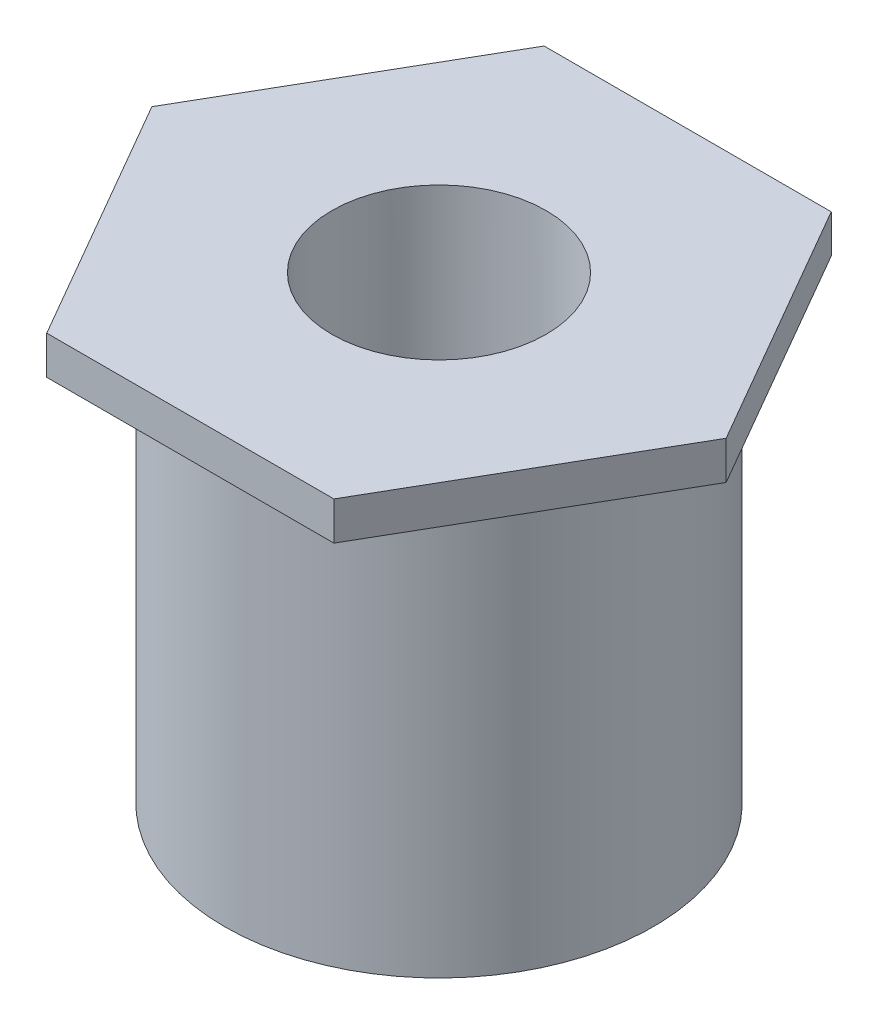
ISO-10303-21;
HEADER;
FILE_DESCRIPTION(('STEP AP214'),'2;1');
FILE_NAME('part.step','',(''),(''),'','','');
FILE_SCHEMA(('AUTOMOTIVE_DESIGN { 1 0 10303 214 1 1 1 1 }'));
ENDSEC;
DATA;
#1=APPLICATION_CONTEXT('core data for automotive mechanical design processes');
#2=APPLICATION_PROTOCOL_DEFINITION('international standard','automotive_design',2000,#1);
#3=PRODUCT_CONTEXT('',#1,'mechanical');
#4=PRODUCT('Part','Part','',(#3));
#5=PRODUCT_RELATED_PRODUCT_CATEGORY('part','',(#4));
#6=PRODUCT_DEFINITION_FORMATION('','',#4);
#7=PRODUCT_DEFINITION_CONTEXT('part definition',#1,'design');
#8=PRODUCT_DEFINITION('design','',#6,#7);
#9=PRODUCT_DEFINITION_SHAPE('','',#8);
#10=(LENGTH_UNIT() NAMED_UNIT(*) SI_UNIT(.MILLI.,.METRE.));
#11=(NAMED_UNIT(*) PLANE_ANGLE_UNIT() SI_UNIT($,.RADIAN.));
#12=(NAMED_UNIT(*) SI_UNIT($,.STERADIAN.) SOLID_ANGLE_UNIT());
#13=UNCERTAINTY_MEASURE_WITH_UNIT(LENGTH_MEASURE(1.E-05),#10,'distance_accuracy_value','');
#14=(GEOMETRIC_REPRESENTATION_CONTEXT(3) GLOBAL_UNCERTAINTY_ASSIGNED_CONTEXT((#13)) GLOBAL_UNIT_ASSIGNED_CONTEXT((#10,
#11,#12)) REPRESENTATION_CONTEXT('',''));
#15=CARTESIAN_POINT('',(0.,0.,0.));
#16=DIRECTION('',(0.,0.,1.));
#17=DIRECTION('',(1.,0.,0.));
#18=AXIS2_PLACEMENT_3D('',#15,#16,#17);
#19=CARTESIAN_POINT('',(0.,-5.5,0.));
#20=DIRECTION('',(0.,-1.,0.));
#21=DIRECTION('',(0.,0.,-1.));
#22=AXIS2_PLACEMENT_3D('',#19,#20,#21);
#23=PLANE('',#22);
#24=CARTESIAN_POINT('',(0.,-5.5,0.));
#25=DIRECTION('',(0.,-1.,0.));
#26=DIRECTION('',(1.,0.,0.));
#27=AXIS2_PLACEMENT_3D('',#24,#25,#26);
#28=CIRCLE('',#27,1.4);
#29=CARTESIAN_POINT('',(1.4,-5.5,0.));
#30=VERTEX_POINT('',#29);
#31=EDGE_CURVE('E27',#30,#30,#28,.T.);
#32=ORIENTED_EDGE('',*,*,#31,.F.);
#33=EDGE_LOOP('',(#32));
#34=FACE_BOUND('',#33,.T.);
#35=CARTESIAN_POINT('',(0.,-5.5,0.));
#36=DIRECTION('',(0.,1.,0.));
#37=DIRECTION('',(0.,0.,-1.));
#38=AXIS2_PLACEMENT_3D('',#35,#36,#37);
#39=CIRCLE('',#38,2.8);
#40=CARTESIAN_POINT('',(0.,-5.5,-2.8));
#41=VERTEX_POINT('',#40);
#42=EDGE_CURVE('E11',#41,#41,#39,.T.);
#43=ORIENTED_EDGE('',*,*,#42,.F.);
#44=EDGE_LOOP('',(#43));
#45=FACE_BOUND('',#44,.T.);
#46=ADVANCED_FACE('F17',(#34,#45),#23,.T.);
#47=CARTESIAN_POINT('',(0.,0.,0.));
#48=DIRECTION('',(0.,-1.,0.));
#49=DIRECTION('',(0.,0.,1.));
#50=AXIS2_PLACEMENT_3D('',#47,#48,#49);
#51=CYLINDRICAL_SURFACE('',#50,2.8);
#52=ORIENTED_EDGE('',*,*,#42,.T.);
#53=EDGE_LOOP('',(#52));
#54=FACE_BOUND('',#53,.T.);
#55=CARTESIAN_POINT('',(0.,0.,0.));
#56=DIRECTION('',(0.,-1.,0.));
#57=DIRECTION('',(0.,0.,1.));
#58=AXIS2_PLACEMENT_3D('',#55,#56,#57);
#59=CIRCLE('',#58,2.8);
#60=CARTESIAN_POINT('',(0.,0.,2.8));
#61=VERTEX_POINT('',#60);
#62=EDGE_CURVE('E133',#61,#61,#59,.T.);
#63=ORIENTED_EDGE('',*,*,#62,.T.);
#64=EDGE_LOOP('',(#63));
#65=FACE_BOUND('',#64,.T.);
#66=ADVANCED_FACE('F177',(#54,#65),#51,.T.);
#67=CARTESIAN_POINT('',(0.,-5.5,0.));
#68=DIRECTION('',(0.,-1.,0.));
#69=DIRECTION('',(1.,0.,0.));
#70=AXIS2_PLACEMENT_3D('',#67,#68,#69);
#71=CYLINDRICAL_SURFACE('',#70,1.4);
#72=ORIENTED_EDGE('',*,*,#31,.T.);
#73=EDGE_LOOP('',(#72));
#74=FACE_BOUND('',#73,.T.);
#75=CARTESIAN_POINT('',(0.,0.5,0.));
#76=DIRECTION('',(0.,1.,0.));
#77=DIRECTION('',(-1.,0.,0.));
#78=AXIS2_PLACEMENT_3D('',#75,#76,#77);
#79=CIRCLE('',#78,1.4);
#80=CARTESIAN_POINT('',(-1.4,0.5,0.));
#81=VERTEX_POINT('',#80);
#82=EDGE_CURVE('E164',#81,#81,#79,.T.);
#83=ORIENTED_EDGE('',*,*,#82,.T.);
#84=EDGE_LOOP('',(#83));
#85=FACE_BOUND('',#84,.T.);
#86=ADVANCED_FACE('F19',(#74,#85),#71,.F.);
#87=CARTESIAN_POINT('',(0.,0.5,0.));
#88=DIRECTION('',(0.,1.,0.));
#89=DIRECTION('',(1.,0.,0.));
#90=AXIS2_PLACEMENT_3D('',#87,#88,#89);
#91=PLANE('',#90);
#92=ORIENTED_EDGE('',*,*,#82,.F.);
#93=EDGE_LOOP('',(#92));
#94=FACE_BOUND('',#93,.T.);
#95=DIRECTION('',(0.500000000000017,0.,-0.866025403784429));
#96=VECTOR('',#95,1.);
#97=CARTESIAN_POINT('',(-3.75000000000014,0.5,-2.50233437232243E-13));
#98=LINE('',#97,#96);
#99=CARTESIAN_POINT('',(-3.75000000000014,0.5,-2.50022225145585E-13));
#100=VERTEX_POINT('',#99);
#101=CARTESIAN_POINT('',(-1.875,0.5,-3.247595264192));
#102=VERTEX_POINT('',#101);
#103=EDGE_CURVE('E89',#100,#102,#98,.T.);
#104=ORIENTED_EDGE('',*,*,#103,.F.);
#105=DIRECTION('',(-0.500000000000017,0.,-0.866025403784429));
#106=VECTOR('',#105,1.);
#107=CARTESIAN_POINT('',(-1.87499999999971,0.5,3.247595264192));
#108=LINE('',#107,#106);
#109=CARTESIAN_POINT('',(-1.87499999999986,0.5,3.247595264192));
#110=VERTEX_POINT('',#109);
#111=EDGE_CURVE('E39',#110,#100,#108,.T.);
#112=ORIENTED_EDGE('',*,*,#111,.F.);
#113=DIRECTION('',(-1.,0.,0.));
#114=VECTOR('',#113,1.);
#115=CARTESIAN_POINT('',(1.875,0.5,3.247595264192));
#116=LINE('',#115,#114);
#117=CARTESIAN_POINT('',(1.875,0.5,3.247595264192));
#118=VERTEX_POINT('',#117);
#119=EDGE_CURVE('E152',#118,#110,#116,.T.);
#120=ORIENTED_EDGE('',*,*,#119,.F.);
#121=DIRECTION('',(-0.500000000000017,0.,0.866025403784429));
#122=VECTOR('',#121,1.);
#123=CARTESIAN_POINT('',(3.75000000000014,0.5,2.50233437232243E-13));
#124=LINE('',#123,#122);
#125=CARTESIAN_POINT('',(3.75000000000007,0.5,1.24989534481504E-13));
#126=VERTEX_POINT('',#125);
#127=EDGE_CURVE('E146',#126,#118,#124,.T.);
#128=ORIENTED_EDGE('',*,*,#127,.F.);
#129=DIRECTION('',(0.500000000000017,0.,0.866025403784429));
#130=VECTOR('',#129,1.);
#131=CARTESIAN_POINT('',(1.87499999999971,0.5,-3.247595264192));
#132=LINE('',#131,#130);
#133=CARTESIAN_POINT('',(1.87499999999986,0.5,-3.247595264192));
#134=VERTEX_POINT('',#133);
#135=EDGE_CURVE('E117',#134,#126,#132,.T.);
#136=ORIENTED_EDGE('',*,*,#135,.F.);
#137=DIRECTION('',(1.,0.,0.));
#138=VECTOR('',#137,1.);
#139=CARTESIAN_POINT('',(-1.875,0.5,-3.247595264192));
#140=LINE('',#139,#138);
#141=EDGE_CURVE('E93',#102,#134,#140,.T.);
#142=ORIENTED_EDGE('',*,*,#141,.F.);
#143=EDGE_LOOP('',(#104,#112,#120,#128,#136,#142));
#144=FACE_BOUND('',#143,.T.);
#145=ADVANCED_FACE('F209',(#94,#144),#91,.T.);
#146=CARTESIAN_POINT('',(-3.75,0.,0.));
#147=DIRECTION('',(-0.866025403784429,0.,0.500000000000017));
#148=DIRECTION('',(0.,1.,0.));
#149=AXIS2_PLACEMENT_3D('',#146,#147,#148);
#150=PLANE('',#149);
#151=DIRECTION('',(0.500000000000017,0.,0.866025403784429));
#152=VECTOR('',#151,1.);
#153=CARTESIAN_POINT('',(-3.75000000000014,0.,-2.50233437232243E-13));
#154=LINE('',#153,#152);
#155=CARTESIAN_POINT('',(-3.75000000000007,0.,-1.24989534481504E-13));
#156=VERTEX_POINT('',#155);
#157=CARTESIAN_POINT('',(-1.87499999999986,0.,3.247595264192));
#158=VERTEX_POINT('',#157);
#159=EDGE_CURVE('E110',#156,#158,#154,.T.);
#160=ORIENTED_EDGE('',*,*,#159,.T.);
#161=DIRECTION('',(0.,-1.,0.));
#162=VECTOR('',#161,1.);
#163=CARTESIAN_POINT('',(-1.87499999999978,0.5,3.24759526419187));
#164=LINE('',#163,#162);
#165=EDGE_CURVE('E159',#110,#158,#164,.T.);
#166=ORIENTED_EDGE('',*,*,#165,.F.);
#167=ORIENTED_EDGE('',*,*,#111,.T.);
#168=DIRECTION('',(0.,-1.,0.));
#169=VECTOR('',#168,1.);
#170=CARTESIAN_POINT('',(-3.75000000000022,0.5,-1.25233157177718E-13));
#171=LINE('',#170,#169);
#172=EDGE_CURVE('E137',#100,#156,#171,.T.);
#173=ORIENTED_EDGE('',*,*,#172,.T.);
#174=EDGE_LOOP('',(#160,#166,#167,#173));
#175=FACE_BOUND('',#174,.T.);
#176=ADVANCED_FACE('F194',(#175),#150,.T.);
#177=CARTESIAN_POINT('',(-1.875,0.,3.247595264192));
#178=DIRECTION('',(0.,0.,1.));
#179=DIRECTION('',(1.,0.,0.));
#180=AXIS2_PLACEMENT_3D('',#177,#178,#179);
#181=PLANE('',#180);
#182=DIRECTION('',(-1.,0.,0.));
#183=VECTOR('',#182,1.);
#184=CARTESIAN_POINT('',(1.875,0.,3.247595264192));
#185=LINE('',#184,#183);
#186=CARTESIAN_POINT('',(1.875,0.,3.247595264192));
#187=VERTEX_POINT('',#186);
#188=EDGE_CURVE('E128',#187,#158,#185,.T.);
#189=ORIENTED_EDGE('',*,*,#188,.F.);
#190=DIRECTION('',(0.,-1.,0.));
#191=VECTOR('',#190,1.);
#192=CARTESIAN_POINT('',(1.875,0.5,3.247595264192));
#193=LINE('',#192,#191);
#194=EDGE_CURVE('E149',#118,#187,#193,.T.);
#195=ORIENTED_EDGE('',*,*,#194,.F.);
#196=ORIENTED_EDGE('',*,*,#119,.T.);
#197=ORIENTED_EDGE('',*,*,#165,.T.);
#198=EDGE_LOOP('',(#189,#195,#196,#197));
#199=FACE_BOUND('',#198,.T.);
#200=ADVANCED_FACE('F195',(#199),#181,.T.);
#201=CARTESIAN_POINT('',(1.875,0.,3.247595264192));
#202=DIRECTION('',(0.866025403784429,0.,0.500000000000017));
#203=DIRECTION('',(0.,-1.,0.));
#204=AXIS2_PLACEMENT_3D('',#201,#202,#203);
#205=PLANE('',#204);
#206=DIRECTION('',(0.500000000000017,0.,-0.866025403784429));
#207=VECTOR('',#206,1.);
#208=CARTESIAN_POINT('',(1.875,0.,3.247595264192));
#209=LINE('',#208,#207);
#210=CARTESIAN_POINT('',(3.75000000000007,0.,1.24989534481504E-13));
#211=VERTEX_POINT('',#210);
#212=EDGE_CURVE('E124',#187,#211,#209,.T.);
#213=ORIENTED_EDGE('',*,*,#212,.T.);
#214=DIRECTION('',(0.,-1.,0.));
#215=VECTOR('',#214,1.);
#216=CARTESIAN_POINT('',(3.75000000000022,0.5,1.25233157177718E-13));
#217=LINE('',#216,#215);
#218=EDGE_CURVE('E121',#126,#211,#217,.T.);
#219=ORIENTED_EDGE('',*,*,#218,.F.);
#220=ORIENTED_EDGE('',*,*,#127,.T.);
#221=ORIENTED_EDGE('',*,*,#194,.T.);
#222=EDGE_LOOP('',(#213,#219,#220,#221));
#223=FACE_BOUND('',#222,.T.);
#224=ADVANCED_FACE('F197',(#223),#205,.T.);
#225=CARTESIAN_POINT('',(3.75,0.,0.));
#226=DIRECTION('',(0.866025403784429,0.,-0.500000000000017));
#227=DIRECTION('',(0.,-1.,0.));
#228=AXIS2_PLACEMENT_3D('',#225,#226,#227);
#229=PLANE('',#228);
#230=DIRECTION('',(-0.500000000000017,0.,-0.866025403784429));
#231=VECTOR('',#230,1.);
#232=CARTESIAN_POINT('',(3.75000000000014,0.,2.50233437232243E-13));
#233=LINE('',#232,#231);
#234=CARTESIAN_POINT('',(1.87499999999986,0.,-3.247595264192));
#235=VERTEX_POINT('',#234);
#236=EDGE_CURVE('E104',#211,#235,#233,.T.);
#237=ORIENTED_EDGE('',*,*,#236,.T.);
#238=DIRECTION('',(0.,-1.,0.));
#239=VECTOR('',#238,1.);
#240=CARTESIAN_POINT('',(1.87499999999978,0.5,-3.24759526419187));
#241=LINE('',#240,#239);
#242=EDGE_CURVE('E99',#134,#235,#241,.T.);
#243=ORIENTED_EDGE('',*,*,#242,.F.);
#244=ORIENTED_EDGE('',*,*,#135,.T.);
#245=ORIENTED_EDGE('',*,*,#218,.T.);
#246=EDGE_LOOP('',(#237,#243,#244,#245));
#247=FACE_BOUND('',#246,.T.);
#248=ADVANCED_FACE('F202',(#247),#229,.T.);
#249=CARTESIAN_POINT('',(1.875,0.,-3.247595264192));
#250=DIRECTION('',(0.,0.,-1.));
#251=DIRECTION('',(0.,-1.,0.));
#252=AXIS2_PLACEMENT_3D('',#249,#250,#251);
#253=PLANE('',#252);
#254=DIRECTION('',(1.,0.,0.));
#255=VECTOR('',#254,1.);
#256=CARTESIAN_POINT('',(-1.875,0.,-3.247595264192));
#257=LINE('',#256,#255);
#258=CARTESIAN_POINT('',(-1.875,0.,-3.247595264192));
#259=VERTEX_POINT('',#258);
#260=EDGE_CURVE('E96',#259,#235,#257,.T.);
#261=ORIENTED_EDGE('',*,*,#260,.F.);
#262=DIRECTION('',(0.,-1.,0.));
#263=VECTOR('',#262,1.);
#264=CARTESIAN_POINT('',(-1.875,0.5,-3.247595264192));
#265=LINE('',#264,#263);
#266=EDGE_CURVE('E83',#102,#259,#265,.T.);
#267=ORIENTED_EDGE('',*,*,#266,.F.);
#268=ORIENTED_EDGE('',*,*,#141,.T.);
#269=ORIENTED_EDGE('',*,*,#242,.T.);
#270=EDGE_LOOP('',(#261,#267,#268,#269));
#271=FACE_BOUND('',#270,.T.);
#272=ADVANCED_FACE('F97',(#271),#253,.T.);
#273=CARTESIAN_POINT('',(-1.875,0.,-3.247595264192));
#274=DIRECTION('',(-0.866025403784429,0.,-0.500000000000017));
#275=DIRECTION('',(-0.500000000000017,0.,0.866025403784429));
#276=AXIS2_PLACEMENT_3D('',#273,#274,#275);
#277=PLANE('',#276);
#278=DIRECTION('',(-0.500000000000017,0.,0.866025403784429));
#279=VECTOR('',#278,1.);
#280=CARTESIAN_POINT('',(-1.875,0.,-3.247595264192));
#281=LINE('',#280,#279);
#282=EDGE_CURVE('E88',#259,#156,#281,.T.);
#283=ORIENTED_EDGE('',*,*,#282,.T.);
#284=ORIENTED_EDGE('',*,*,#172,.F.);
#285=ORIENTED_EDGE('',*,*,#103,.T.);
#286=ORIENTED_EDGE('',*,*,#266,.T.);
#287=EDGE_LOOP('',(#283,#284,#285,#286));
#288=FACE_BOUND('',#287,.T.);
#289=ADVANCED_FACE('F85',(#288),#277,.T.);
#290=CARTESIAN_POINT('',(0.,0.,0.));
#291=DIRECTION('',(0.,1.,0.));
#292=DIRECTION('',(1.,0.,0.));
#293=AXIS2_PLACEMENT_3D('',#290,#291,#292);
#294=PLANE('',#293);
#295=ORIENTED_EDGE('',*,*,#62,.F.);
#296=EDGE_LOOP('',(#295));
#297=FACE_BOUND('',#296,.T.);
#298=ORIENTED_EDGE('',*,*,#282,.F.);
#299=ORIENTED_EDGE('',*,*,#260,.T.);
#300=ORIENTED_EDGE('',*,*,#236,.F.);
#301=ORIENTED_EDGE('',*,*,#212,.F.);
#302=ORIENTED_EDGE('',*,*,#188,.T.);
#303=ORIENTED_EDGE('',*,*,#159,.F.);
#304=EDGE_LOOP('',(#298,#299,#300,#301,#302,#303));
#305=FACE_BOUND('',#304,.T.);
#306=ADVANCED_FACE('F107',(#297,#305),#294,.F.);
#307=CLOSED_SHELL('',(#46,#66,#86,#145,#176,#200,#224,#248,#272,#289,#306));
#308=MANIFOLD_SOLID_BREP('B1',#307);
#309=ADVANCED_BREP_SHAPE_REPRESENTATION('',(#18,#308),#14);
#310=SHAPE_DEFINITION_REPRESENTATION(#9,#309);
ENDSEC;
END-ISO-10303-21;
